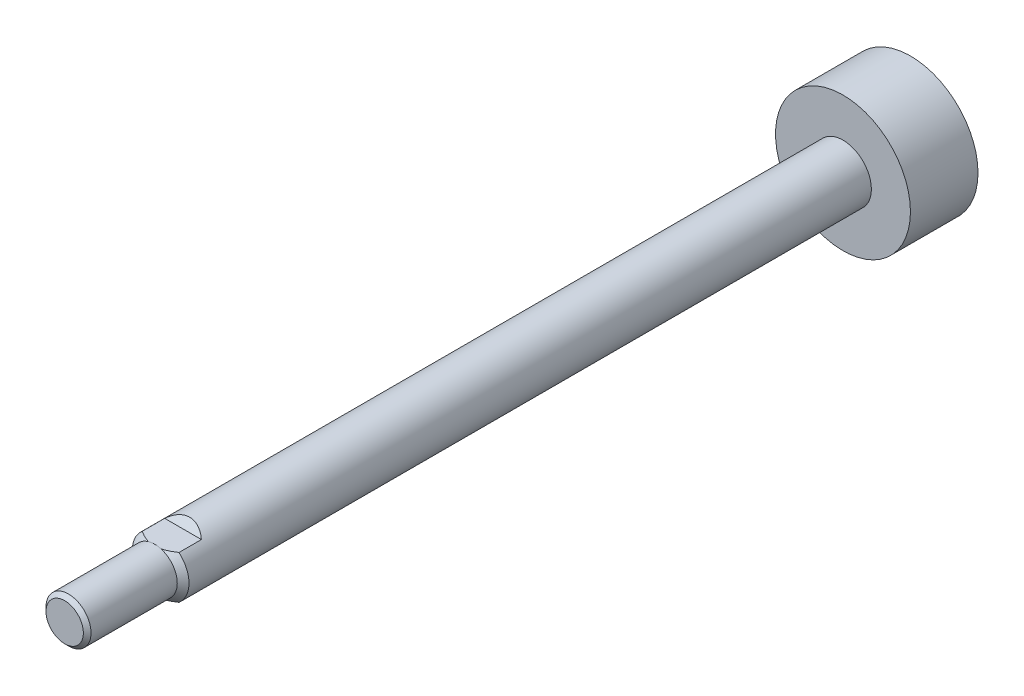
ISO-10303-21;
HEADER;
FILE_DESCRIPTION(('STEP AP214'),'2;1');
FILE_NAME('part.step','',(''),(''),'','','');
FILE_SCHEMA(('AUTOMOTIVE_DESIGN { 1 0 10303 214 1 1 1 1 }'));
ENDSEC;
DATA;
#1=APPLICATION_CONTEXT('core data for automotive mechanical design processes');
#2=APPLICATION_PROTOCOL_DEFINITION('international standard','automotive_design',2000,#1);
#3=PRODUCT_CONTEXT('',#1,'mechanical');
#4=PRODUCT('Part','Part','',(#3));
#5=PRODUCT_RELATED_PRODUCT_CATEGORY('part','',(#4));
#6=PRODUCT_DEFINITION_FORMATION('','',#4);
#7=PRODUCT_DEFINITION_CONTEXT('part definition',#1,'design');
#8=PRODUCT_DEFINITION('design','',#6,#7);
#9=PRODUCT_DEFINITION_SHAPE('','',#8);
#10=(LENGTH_UNIT() NAMED_UNIT(*) SI_UNIT(.MILLI.,.METRE.));
#11=(NAMED_UNIT(*) PLANE_ANGLE_UNIT() SI_UNIT($,.RADIAN.));
#12=(NAMED_UNIT(*) SI_UNIT($,.STERADIAN.) SOLID_ANGLE_UNIT());
#13=UNCERTAINTY_MEASURE_WITH_UNIT(LENGTH_MEASURE(1.E-05),#10,'distance_accuracy_value','');
#14=(GEOMETRIC_REPRESENTATION_CONTEXT(3) GLOBAL_UNCERTAINTY_ASSIGNED_CONTEXT((#13)) GLOBAL_UNIT_ASSIGNED_CONTEXT((#10,
#11,#12)) REPRESENTATION_CONTEXT('',''));
#15=CARTESIAN_POINT('',(0.,0.,0.));
#16=DIRECTION('',(0.,0.,1.));
#17=DIRECTION('',(1.,0.,0.));
#18=AXIS2_PLACEMENT_3D('',#15,#16,#17);
#19=CARTESIAN_POINT('',(0.,0.,12.7));
#20=DIRECTION('',(0.,0.,-1.));
#21=DIRECTION('',(-1.,0.,0.));
#22=AXIS2_PLACEMENT_3D('',#19,#20,#21);
#23=PLANE('',#22);
#24=CARTESIAN_POINT('',(0.,0.,12.6999999999384));
#25=DIRECTION('',(0.,0.,-1.));
#26=DIRECTION('',(-1.,0.,0.));
#27=AXIS2_PLACEMENT_3D('',#24,#25,#26);
#28=CIRCLE('',#27,2.63398000004145);
#29=CARTESIAN_POINT('',(-2.63398000004145,0.,12.6999999999384));
#30=VERTEX_POINT('',#29);
#31=EDGE_CURVE('E19',#30,#30,#28,.T.);
#32=ORIENTED_EDGE('',*,*,#31,.F.);
#33=EDGE_LOOP('',(#32));
#34=FACE_BOUND('',#33,.T.);
#35=ADVANCED_FACE('F16',(#34),#23,.F.);
#36=CARTESIAN_POINT('',(0.,9.5123,-106.57205));
#37=DIRECTION('',(0.,0.,1.));
#38=DIRECTION('',(1.,0.,0.));
#39=AXIS2_PLACEMENT_3D('',#36,#37,#38);
#40=PLANE('',#39);
#41=CARTESIAN_POINT('',(0.,0.,-106.57205));
#42=DIRECTION('',(0.,0.,1.));
#43=DIRECTION('',(1.,0.,0.));
#44=AXIS2_PLACEMENT_3D('',#41,#42,#43);
#45=CIRCLE('',#44,9.5123);
#46=CARTESIAN_POINT('',(9.5123,0.,-106.57205));
#47=VERTEX_POINT('',#46);
#48=EDGE_CURVE('E78',#47,#47,#45,.T.);
#49=ORIENTED_EDGE('',*,*,#48,.F.);
#50=EDGE_LOOP('',(#49));
#51=FACE_BOUND('',#50,.T.);
#52=ADVANCED_FACE('F207',(#51),#40,.F.);
#53=CARTESIAN_POINT('',(0.,0.,12.1589800000379));
#54=DIRECTION('',(0.,0.,-1.));
#55=DIRECTION('',(-1.,0.,0.));
#56=AXIS2_PLACEMENT_3D('',#53,#54,#55);
#57=CONICAL_SURFACE('',#56,3.17499999994197,0.785398163397448);
#58=ORIENTED_EDGE('',*,*,#31,.T.);
#59=EDGE_LOOP('',(#58));
#60=FACE_BOUND('',#59,.T.);
#61=CARTESIAN_POINT('',(0.,0.,12.15898));
#62=DIRECTION('',(0.,0.,1.));
#63=DIRECTION('',(1.,0.,0.));
#64=AXIS2_PLACEMENT_3D('',#61,#62,#63);
#65=CIRCLE('',#64,3.175);
#66=CARTESIAN_POINT('',(3.175,0.,12.15898));
#67=VERTEX_POINT('',#66);
#68=EDGE_CURVE('E77',#67,#67,#65,.F.);
#69=ORIENTED_EDGE('',*,*,#68,.F.);
#70=EDGE_LOOP('',(#69));
#71=FACE_BOUND('',#70,.T.);
#72=ADVANCED_FACE('F203',(#60,#71),#57,.T.);
#73=CARTESIAN_POINT('',(0.,0.,-106.57205));
#74=DIRECTION('',(0.,0.,1.));
#75=DIRECTION('',(1.,0.,0.));
#76=AXIS2_PLACEMENT_3D('',#73,#74,#75);
#77=CYLINDRICAL_SURFACE('',#76,9.5123);
#78=CARTESIAN_POINT('',(0.,0.,-97.04705));
#79=DIRECTION('',(0.,0.,1.));
#80=DIRECTION('',(1.,0.,0.));
#81=AXIS2_PLACEMENT_3D('',#78,#79,#80);
#82=CIRCLE('',#81,9.5123);
#83=CARTESIAN_POINT('',(9.5123,0.,-97.04705));
#84=VERTEX_POINT('',#83);
#85=EDGE_CURVE('E89',#84,#84,#82,.F.);
#86=ORIENTED_EDGE('',*,*,#85,.T.);
#87=EDGE_LOOP('',(#86));
#88=FACE_BOUND('',#87,.T.);
#89=ORIENTED_EDGE('',*,*,#48,.T.);
#90=EDGE_LOOP('',(#89));
#91=FACE_BOUND('',#90,.T.);
#92=ADVANCED_FACE('F215',(#88,#91),#77,.T.);
#93=CARTESIAN_POINT('',(8.001,6.096,0.));
#94=DIRECTION('',(0.,0.,-1.));
#95=DIRECTION('',(-1.,0.,0.));
#96=AXIS2_PLACEMENT_3D('',#93,#94,#95);
#97=PLANE('',#96);
#98=DIRECTION('',(1.,0.,0.));
#99=VECTOR('',#98,1.);
#100=CARTESIAN_POINT('',(8.001,3.048,0.));
#101=LINE('',#100,#99);
#102=CARTESIAN_POINT('',(-0.888999999997889,3.048,0.));
#103=VERTEX_POINT('',#102);
#104=CARTESIAN_POINT('',(0.888999999997889,3.048,0.));
#105=VERTEX_POINT('',#104);
#106=EDGE_CURVE('E91',#103,#105,#101,.T.);
#107=ORIENTED_EDGE('',*,*,#106,.F.);
#108=CARTESIAN_POINT('',(0.,0.,0.));
#109=DIRECTION('',(0.,0.,1.));
#110=DIRECTION('',(1.,0.,0.));
#111=AXIS2_PLACEMENT_3D('',#108,#109,#110);
#112=CIRCLE('',#111,3.175);
#113=EDGE_CURVE('E66',#105,#103,#112,.T.);
#114=ORIENTED_EDGE('',*,*,#113,.F.);
#115=EDGE_LOOP('',(#107,#114));
#116=FACE_BOUND('',#115,.T.);
#117=ADVANCED_FACE('F92',(#116),#97,.T.);
#118=CARTESIAN_POINT('',(0.,0.,-106.57205));
#119=DIRECTION('',(0.,0.,1.));
#120=DIRECTION('',(1.,0.,0.));
#121=AXIS2_PLACEMENT_3D('',#118,#119,#120);
#122=CYLINDRICAL_SURFACE('',#121,3.175);
#123=ORIENTED_EDGE('',*,*,#68,.T.);
#124=EDGE_LOOP('',(#123));
#125=FACE_BOUND('',#124,.T.);
#126=CARTESIAN_POINT('',(0.,0.,0.));
#127=DIRECTION('',(0.,0.,1.));
#128=DIRECTION('',(1.,0.,0.));
#129=AXIS2_PLACEMENT_3D('',#126,#127,#128);
#130=CIRCLE('',#129,3.175);
#131=CARTESIAN_POINT('',(0.888999999997889,-3.048,0.));
#132=VERTEX_POINT('',#131);
#133=CARTESIAN_POINT('',(-0.888999999997889,-3.048,0.));
#134=VERTEX_POINT('',#133);
#135=EDGE_CURVE('E178',#132,#134,#130,.F.);
#136=ORIENTED_EDGE('',*,*,#135,.F.);
#137=CARTESIAN_POINT('',(0.,0.,0.));
#138=DIRECTION('',(0.,0.,-1.));
#139=DIRECTION('',(-1.,0.,0.));
#140=AXIS2_PLACEMENT_3D('',#137,#138,#139);
#141=CIRCLE('',#140,3.17499999999882);
#142=EDGE_CURVE('E75',#105,#132,#141,.T.);
#143=ORIENTED_EDGE('',*,*,#142,.F.);
#144=ORIENTED_EDGE('',*,*,#113,.T.);
#145=CARTESIAN_POINT('',(0.,0.,0.));
#146=DIRECTION('',(0.,0.,-1.));
#147=DIRECTION('',(-1.,0.,0.));
#148=AXIS2_PLACEMENT_3D('',#145,#146,#147);
#149=CIRCLE('',#148,3.17499999999882);
#150=EDGE_CURVE('E72',#134,#103,#149,.T.);
#151=ORIENTED_EDGE('',*,*,#150,.F.);
#152=EDGE_LOOP('',(#136,#143,#144,#151));
#153=FACE_BOUND('',#152,.T.);
#154=ADVANCED_FACE('F71',(#125,#153),#122,.T.);
#155=CARTESIAN_POINT('',(8.001,-3.048,0.));
#156=DIRECTION('',(0.,0.,-1.));
#157=DIRECTION('',(-1.,0.,0.));
#158=AXIS2_PLACEMENT_3D('',#155,#156,#157);
#159=PLANE('',#158);
#160=ORIENTED_EDGE('',*,*,#135,.T.);
#161=DIRECTION('',(1.,0.,0.));
#162=VECTOR('',#161,1.);
#163=CARTESIAN_POINT('',(8.001,-3.048,0.));
#164=LINE('',#163,#162);
#165=EDGE_CURVE('E168',#132,#134,#164,.F.);
#166=ORIENTED_EDGE('',*,*,#165,.F.);
#167=EDGE_LOOP('',(#160,#166));
#168=FACE_BOUND('',#167,.T.);
#169=ADVANCED_FACE('F195',(#168),#159,.T.);
#170=CARTESIAN_POINT('',(0.,4.0005,-97.04705));
#171=DIRECTION('',(0.,0.,-1.));
#172=DIRECTION('',(-1.,0.,0.));
#173=AXIS2_PLACEMENT_3D('',#170,#171,#172);
#174=PLANE('',#173);
#175=CARTESIAN_POINT('',(0.,0.,-97.04705));
#176=DIRECTION('',(0.,0.,1.));
#177=DIRECTION('',(1.,0.,0.));
#178=AXIS2_PLACEMENT_3D('',#175,#176,#177);
#179=CIRCLE('',#178,4.0005);
#180=CARTESIAN_POINT('',(4.0005,0.,-97.04705));
#181=VERTEX_POINT('',#180);
#182=EDGE_CURVE('E162',#181,#181,#179,.T.);
#183=ORIENTED_EDGE('',*,*,#182,.F.);
#184=EDGE_LOOP('',(#183));
#185=FACE_BOUND('',#184,.T.);
#186=ORIENTED_EDGE('',*,*,#85,.F.);
#187=EDGE_LOOP('',(#186));
#188=FACE_BOUND('',#187,.T.);
#189=ADVANCED_FACE('F121',(#185,#188),#174,.F.);
#190=CARTESIAN_POINT('',(0.,0.,-0.825500000019019));
#191=DIRECTION('',(0.,0.,-1.));
#192=DIRECTION('',(-1.,0.,0.));
#193=AXIS2_PLACEMENT_3D('',#190,#191,#192);
#194=CONICAL_SURFACE('',#193,4.00050000001784,0.785398163397448);
#195=CARTESIAN_POINT('',(-2.59108013191357,3.048,-0.825500000000836));
#196=CARTESIAN_POINT('',(-2.5245787469383,3.048,-0.782433736000968));
#197=CARTESIAN_POINT('',(-2.45764287109544,3.048,-0.740035776470358));
#198=CARTESIAN_POINT('',(-2.32278153430408,3.048,-0.656813485671581));
#199=CARTESIAN_POINT('',(-2.25485586670252,3.048,-0.615989489701885));
#200=CARTESIAN_POINT('',(-2.05022582731277,3.048,-0.496710059814701));
#201=CARTESIAN_POINT('',(-1.91192257981661,3.048,-0.420957250699383));
#202=CARTESIAN_POINT('',(-1.62990348506685,3.048,-0.27927308894989));
#203=CARTESIAN_POINT('',(-1.48617716792997,3.048,-0.213362095160096));
#204=CARTESIAN_POINT('',(-1.2659833932071,3.048,-0.124770715665092));
#205=CARTESIAN_POINT('',(-1.19160952153923,3.048,-0.0968910890218909));
#206=CARTESIAN_POINT('',(-1.04139163330174,3.048,-0.0452202891908669));
#207=CARTESIAN_POINT('',(-0.965546455421188,3.048,-0.0214325050750028));
#208=CARTESIAN_POINT('',(-0.888999999999641,3.048,-1.07954948515557E-12));
#209=B_SPLINE_CURVE_WITH_KNOTS('',3,(#195,#196,#197,#198,#199,#200,#201,#202,#203,#204,#205,
#206,#207,#208),.UNSPECIFIED.,.F.,.F.,(4,2,2,2,2,2,4),(0.,0.237680636477149,0.475411628954728,
0.94819961586915,1.42195245524382,1.66012772015512,1.89849931388161),.UNSPECIFIED.);
#210=CARTESIAN_POINT('',(-2.59108013191384,3.048,-0.825500000000421));
#211=VERTEX_POINT('',#210);
#212=EDGE_CURVE('E84',#211,#103,#209,.T.);
#213=ORIENTED_EDGE('',*,*,#212,.F.);
#214=CARTESIAN_POINT('',(0.,0.,-0.825500000000007));
#215=DIRECTION('',(0.,0.,1.));
#216=DIRECTION('',(1.,0.,0.));
#217=AXIS2_PLACEMENT_3D('',#214,#215,#216);
#218=CIRCLE('',#217,4.0005);
#219=CARTESIAN_POINT('',(-2.59108013191384,-3.048,-0.825500000000421));
#220=VERTEX_POINT('',#219);
#221=EDGE_CURVE('E166',#220,#211,#218,.F.);
#222=ORIENTED_EDGE('',*,*,#221,.F.);
#223=CARTESIAN_POINT('',(-0.888999999999642,-3.048,-1.08192351982073E-12));
#224=CARTESIAN_POINT('',(-1.02251233905902,-3.048,-0.0374409701690382));
#225=CARTESIAN_POINT('',(-1.15377351574946,-3.048,-0.08190749576995));
#226=CARTESIAN_POINT('',(-1.41166914594608,-3.048,-0.181919877276082));
#227=CARTESIAN_POINT('',(-1.53831437114978,-3.048,-0.237437684987115));
#228=CARTESIAN_POINT('',(-1.78665081988931,-3.048,-0.356380332584577));
#229=CARTESIAN_POINT('',(-1.90837046213328,-3.048,-0.419747249329886));
#230=CARTESIAN_POINT('',(-2.14839989144078,-3.048,-0.552725124860477));
#231=CARTESIAN_POINT('',(-2.26670818994804,-3.048,-0.622338756537196));
#232=CARTESIAN_POINT('',(-2.41836334986857,-3.048,-0.715763216039787));
#233=CARTESIAN_POINT('',(-2.45305600946678,-3.048,-0.73742536639303));
#234=CARTESIAN_POINT('',(-2.5222313800877,-3.048,-0.78116412627651));
#235=CARTESIAN_POINT('',(-2.55671382520683,-3.048,-0.803241156468486));
#236=CARTESIAN_POINT('',(-2.59108013191357,-3.048,-0.825500000000836));
#237=B_SPLINE_CURVE_WITH_KNOTS('',3,(#223,#224,#225,#226,#227,#228,#229,#230,#231,#232,#233,
#234,#235,#236),.UNSPECIFIED.,.F.,.F.,(4,2,2,2,2,2,4),(0.,0.41540546194259,0.829769765595444,
1.24124050795268,1.65288816078483,1.77558793923406,1.89841967045774),.UNSPECIFIED.);
#238=EDGE_CURVE('E86',#134,#220,#237,.T.);
#239=ORIENTED_EDGE('',*,*,#238,.F.);
#240=ORIENTED_EDGE('',*,*,#150,.T.);
#241=EDGE_LOOP('',(#213,#222,#239,#240));
#242=FACE_BOUND('',#241,.T.);
#243=ADVANCED_FACE('F81',(#242),#194,.T.);
#244=CARTESIAN_POINT('',(8.001,3.048,-3.9878));
#245=DIRECTION('',(0.,0.707106781186548,0.707106781186547));
#246=DIRECTION('',(0.,-0.707106781186547,0.707106781186548));
#247=AXIS2_PLACEMENT_3D('',#244,#245,#246);
#248=PLANE('',#247);
#249=CARTESIAN_POINT('',(0.,0.,-0.939800000000005));
#250=DIRECTION('',(0.,0.707106781186548,0.707106781186547));
#251=DIRECTION('',(0.,-0.707106781186547,0.707106781186548));
#252=AXIS2_PLACEMENT_3D('',#249,#250,#251);
#253=ELLIPSE('',#252,5.65756135627357,4.0005);
#254=CARTESIAN_POINT('',(-2.5910801319141,3.048,-3.98779999999999));
#255=VERTEX_POINT('',#254);
#256=CARTESIAN_POINT('',(2.5910801319141,3.048,-3.98779999999999));
#257=VERTEX_POINT('',#256);
#258=EDGE_CURVE('E171',#255,#257,#253,.F.);
#259=ORIENTED_EDGE('',*,*,#258,.F.);
#260=DIRECTION('',(1.,0.,0.));
#261=VECTOR('',#260,1.);
#262=CARTESIAN_POINT('',(8.001,3.048,-3.9878));
#263=LINE('',#262,#261);
#264=EDGE_CURVE('E88',#257,#255,#263,.F.);
#265=ORIENTED_EDGE('',*,*,#264,.F.);
#266=EDGE_LOOP('',(#259,#265));
#267=FACE_BOUND('',#266,.T.);
#268=ADVANCED_FACE('F120',(#267),#248,.T.);
#269=CARTESIAN_POINT('',(8.001,3.048,0.));
#270=DIRECTION('',(0.,1.,0.));
#271=DIRECTION('',(0.,0.,1.));
#272=AXIS2_PLACEMENT_3D('',#269,#270,#271);
#273=PLANE('',#272);
#274=ORIENTED_EDGE('',*,*,#212,.T.);
#275=ORIENTED_EDGE('',*,*,#106,.T.);
#276=CARTESIAN_POINT('',(2.59108013191777,3.048,-0.825500000003559));
#277=CARTESIAN_POINT('',(2.52457874694235,3.048,-0.782433736003547));
#278=CARTESIAN_POINT('',(2.45764287109932,3.048,-0.740035776472795));
#279=CARTESIAN_POINT('',(2.32278153430765,3.048,-0.656813485673739));
#280=CARTESIAN_POINT('',(2.25485586670592,3.048,-0.615989489703904));
#281=CARTESIAN_POINT('',(2.05022582731567,3.048,-0.496710059816317));
#282=CARTESIAN_POINT('',(1.91192257981918,3.048,-0.420957250700739));
#283=CARTESIAN_POINT('',(1.62990348506873,3.048,-0.279273088950764));
#284=CARTESIAN_POINT('',(1.48617716793149,3.048,-0.213362095160746));
#285=CARTESIAN_POINT('',(1.26598339320805,3.048,-0.124770715665452));
#286=CARTESIAN_POINT('',(1.19160952153998,3.048,-0.0968910890221616));
#287=CARTESIAN_POINT('',(1.0413916333021,3.048,-0.0452202891909787));
#288=CARTESIAN_POINT('',(0.965546455421343,3.048,-0.0214325050750453));
#289=CARTESIAN_POINT('',(0.88899999999959,3.048,-1.0651448180133E-12));
#290=B_SPLINE_CURVE_WITH_KNOTS('',3,(#276,#277,#278,#279,#280,#281,#282,#283,#284,#285,#286,
#287,#288,#289),.UNSPECIFIED.,.F.,.F.,(4,2,2,2,2,2,4),(0.,0.237680636477783,0.475411628955996,
0.948199615871672,1.4219524552476,1.66012772015954,1.89849931388667),.UNSPECIFIED.);
#291=CARTESIAN_POINT('',(2.59108013191594,3.048,-0.825500000001783));
#292=VERTEX_POINT('',#291);
#293=EDGE_CURVE('E94',#292,#105,#290,.T.);
#294=ORIENTED_EDGE('',*,*,#293,.F.);
#295=DIRECTION('',(0.,0.,1.));
#296=VECTOR('',#295,1.);
#297=CARTESIAN_POINT('',(2.5910801319141,3.048,-106.57205));
#298=LINE('',#297,#296);
#299=EDGE_CURVE('E173',#257,#292,#298,.T.);
#300=ORIENTED_EDGE('',*,*,#299,.F.);
#301=ORIENTED_EDGE('',*,*,#264,.T.);
#302=DIRECTION('',(0.,0.,1.));
#303=VECTOR('',#302,1.);
#304=CARTESIAN_POINT('',(-2.5910801319141,3.048,-106.57205));
#305=LINE('',#304,#303);
#306=EDGE_CURVE('E98',#211,#255,#305,.F.);
#307=ORIENTED_EDGE('',*,*,#306,.F.);
#308=EDGE_LOOP('',(#274,#275,#294,#300,#301,#307));
#309=FACE_BOUND('',#308,.T.);
#310=ADVANCED_FACE('F96',(#309),#273,.T.);
#311=CARTESIAN_POINT('',(0.,0.,-0.825500000019019));
#312=DIRECTION('',(0.,0.,-1.));
#313=DIRECTION('',(-1.,0.,0.));
#314=AXIS2_PLACEMENT_3D('',#311,#312,#313);
#315=CONICAL_SURFACE('',#314,4.00050000001784,0.785398163397448);
#316=ORIENTED_EDGE('',*,*,#293,.T.);
#317=ORIENTED_EDGE('',*,*,#142,.T.);
#318=CARTESIAN_POINT('',(2.59108013191357,-3.048,-0.825500000000836));
#319=CARTESIAN_POINT('',(2.5245787469383,-3.048,-0.782433736000968));
#320=CARTESIAN_POINT('',(2.45764287109544,-3.048,-0.740035776470358));
#321=CARTESIAN_POINT('',(2.32278153430408,-3.048,-0.656813485671582));
#322=CARTESIAN_POINT('',(2.25485586670252,-3.048,-0.615989489701885));
#323=CARTESIAN_POINT('',(2.05022582731277,-3.048,-0.496710059814702));
#324=CARTESIAN_POINT('',(1.91192257981661,-3.048,-0.420957250699383));
#325=CARTESIAN_POINT('',(1.62990348506685,-3.048,-0.279273088949891));
#326=CARTESIAN_POINT('',(1.48617716792998,-3.048,-0.213362095160097));
#327=CARTESIAN_POINT('',(1.2659833932071,-3.048,-0.124770715665093));
#328=CARTESIAN_POINT('',(1.19160952153923,-3.048,-0.0968910890218918));
#329=CARTESIAN_POINT('',(1.04139163330174,-3.048,-0.0452202891908677));
#330=CARTESIAN_POINT('',(0.965546455421191,-3.048,-0.0214325050750036));
#331=CARTESIAN_POINT('',(0.888999999999644,-3.048,-1.08026498315054E-12));
#332=B_SPLINE_CURVE_WITH_KNOTS('',3,(#318,#319,#320,#321,#322,#323,#324,#325,#326,#327,#328,
#329,#330,#331),.UNSPECIFIED.,.F.,.F.,(4,2,2,2,2,2,4),(0.,0.237680636477149,0.475411628954728,
0.948199615869149,1.42195245524381,1.66012772015512,1.89849931388161),.UNSPECIFIED.);
#333=CARTESIAN_POINT('',(2.59108013191384,-3.048,-0.825500000000421));
#334=VERTEX_POINT('',#333);
#335=EDGE_CURVE('E129',#334,#132,#332,.T.);
#336=ORIENTED_EDGE('',*,*,#335,.F.);
#337=CARTESIAN_POINT('',(0.,0.,-0.825500000000007));
#338=DIRECTION('',(0.,0.,1.));
#339=DIRECTION('',(1.,0.,0.));
#340=AXIS2_PLACEMENT_3D('',#337,#338,#339);
#341=CIRCLE('',#340,4.0005);
#342=EDGE_CURVE('E182',#292,#334,#341,.F.);
#343=ORIENTED_EDGE('',*,*,#342,.F.);
#344=EDGE_LOOP('',(#316,#317,#336,#343));
#345=FACE_BOUND('',#344,.T.);
#346=ADVANCED_FACE('F139',(#345),#315,.T.);
#347=CARTESIAN_POINT('',(8.001,-3.048,-3.9878));
#348=DIRECTION('',(0.,-1.,0.));
#349=DIRECTION('',(0.,0.,-1.));
#350=AXIS2_PLACEMENT_3D('',#347,#348,#349);
#351=PLANE('',#350);
#352=ORIENTED_EDGE('',*,*,#335,.T.);
#353=ORIENTED_EDGE('',*,*,#165,.T.);
#354=ORIENTED_EDGE('',*,*,#238,.T.);
#355=DIRECTION('',(0.,0.,1.));
#356=VECTOR('',#355,1.);
#357=CARTESIAN_POINT('',(-2.5910801319141,-3.048,-106.57205));
#358=LINE('',#357,#356);
#359=CARTESIAN_POINT('',(-2.5910801319141,-3.048,-3.98779999999999));
#360=VERTEX_POINT('',#359);
#361=EDGE_CURVE('E164',#360,#220,#358,.T.);
#362=ORIENTED_EDGE('',*,*,#361,.F.);
#363=DIRECTION('',(1.,0.,0.));
#364=VECTOR('',#363,1.);
#365=CARTESIAN_POINT('',(8.001,-3.048,-3.9878));
#366=LINE('',#365,#364);
#367=CARTESIAN_POINT('',(2.5910801319141,-3.048,-3.98779999999999));
#368=VERTEX_POINT('',#367);
#369=EDGE_CURVE('E34',#368,#360,#366,.F.);
#370=ORIENTED_EDGE('',*,*,#369,.F.);
#371=DIRECTION('',(0.,0.,1.));
#372=VECTOR('',#371,1.);
#373=CARTESIAN_POINT('',(2.5910801319141,-3.048,-106.57205));
#374=LINE('',#373,#372);
#375=EDGE_CURVE('E25',#334,#368,#374,.F.);
#376=ORIENTED_EDGE('',*,*,#375,.F.);
#377=EDGE_LOOP('',(#352,#353,#354,#362,#370,#376));
#378=FACE_BOUND('',#377,.T.);
#379=ADVANCED_FACE('F134',(#378),#351,.T.);
#380=CARTESIAN_POINT('',(8.001,-6.096,-7.0358));
#381=DIRECTION('',(0.,-0.707106781186548,0.707106781186547));
#382=DIRECTION('',(0.,-0.707106781186547,-0.707106781186548));
#383=AXIS2_PLACEMENT_3D('',#380,#381,#382);
#384=PLANE('',#383);
#385=CARTESIAN_POINT('',(0.,0.,-0.939800000000005));
#386=DIRECTION('',(0.,-0.707106781186548,0.707106781186547));
#387=DIRECTION('',(0.,0.707106781186547,0.707106781186548));
#388=AXIS2_PLACEMENT_3D('',#385,#386,#387);
#389=ELLIPSE('',#388,5.65756135627357,4.0005);
#390=EDGE_CURVE('E11',#368,#360,#389,.F.);
#391=ORIENTED_EDGE('',*,*,#390,.F.);
#392=ORIENTED_EDGE('',*,*,#369,.T.);
#393=EDGE_LOOP('',(#391,#392));
#394=FACE_BOUND('',#393,.T.);
#395=ADVANCED_FACE('F138',(#394),#384,.T.);
#396=CARTESIAN_POINT('',(0.,0.,-106.57205));
#397=DIRECTION('',(0.,0.,1.));
#398=DIRECTION('',(1.,0.,0.));
#399=AXIS2_PLACEMENT_3D('',#396,#397,#398);
#400=CYLINDRICAL_SURFACE('',#399,4.0005);
#401=ORIENTED_EDGE('',*,*,#375,.T.);
#402=ORIENTED_EDGE('',*,*,#390,.T.);
#403=ORIENTED_EDGE('',*,*,#361,.T.);
#404=ORIENTED_EDGE('',*,*,#221,.T.);
#405=ORIENTED_EDGE('',*,*,#306,.T.);
#406=ORIENTED_EDGE('',*,*,#258,.T.);
#407=ORIENTED_EDGE('',*,*,#299,.T.);
#408=ORIENTED_EDGE('',*,*,#342,.T.);
#409=EDGE_LOOP('',(#401,#402,#403,#404,#405,#406,#407,#408));
#410=FACE_BOUND('',#409,.T.);
#411=ORIENTED_EDGE('',*,*,#182,.T.);
#412=EDGE_LOOP('',(#411));
#413=FACE_BOUND('',#412,.T.);
#414=ADVANCED_FACE('F150',(#410,#413),#400,.T.);
#415=CLOSED_SHELL('',(#35,#52,#72,#92,#117,#154,#169,#189,#243,#268,#310,#346,#379,#395,#414));
#416=MANIFOLD_SOLID_BREP('B1',#415);
#417=ADVANCED_BREP_SHAPE_REPRESENTATION('',(#18,#416),#14);
#418=SHAPE_DEFINITION_REPRESENTATION(#9,#417);
ENDSEC;
END-ISO-10303-21;
